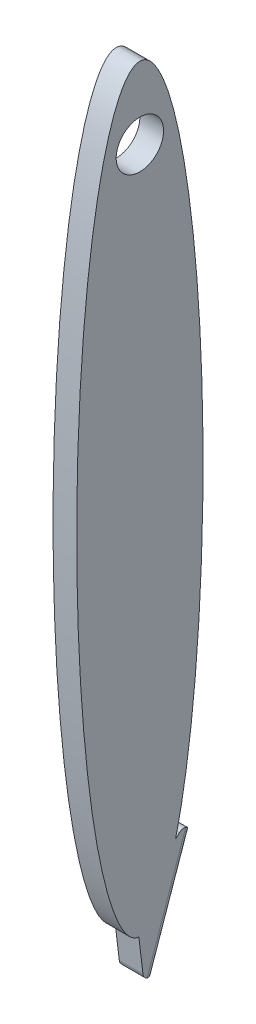
ISO-10303-21;
HEADER;
FILE_DESCRIPTION(('STEP AP214'),'2;1');
FILE_NAME('part.step','',(''),(''),'','','');
FILE_SCHEMA(('AUTOMOTIVE_DESIGN { 1 0 10303 214 1 1 1 1 }'));
ENDSEC;
DATA;
#1=APPLICATION_CONTEXT('core data for automotive mechanical design processes');
#2=APPLICATION_PROTOCOL_DEFINITION('international standard','automotive_design',2000,#1);
#3=PRODUCT_CONTEXT('',#1,'mechanical');
#4=PRODUCT('Part','Part','',(#3));
#5=PRODUCT_RELATED_PRODUCT_CATEGORY('part','',(#4));
#6=PRODUCT_DEFINITION_FORMATION('','',#4);
#7=PRODUCT_DEFINITION_CONTEXT('part definition',#1,'design');
#8=PRODUCT_DEFINITION('design','',#6,#7);
#9=PRODUCT_DEFINITION_SHAPE('','',#8);
#10=(LENGTH_UNIT() NAMED_UNIT(*) SI_UNIT(.MILLI.,.METRE.));
#11=(NAMED_UNIT(*) PLANE_ANGLE_UNIT() SI_UNIT($,.RADIAN.));
#12=(NAMED_UNIT(*) SI_UNIT($,.STERADIAN.) SOLID_ANGLE_UNIT());
#13=UNCERTAINTY_MEASURE_WITH_UNIT(LENGTH_MEASURE(1.E-05),#10,'distance_accuracy_value','');
#14=(GEOMETRIC_REPRESENTATION_CONTEXT(3) GLOBAL_UNCERTAINTY_ASSIGNED_CONTEXT((#13)) GLOBAL_UNIT_ASSIGNED_CONTEXT((#10,
#11,#12)) REPRESENTATION_CONTEXT('',''));
#15=CARTESIAN_POINT('',(0.,0.,0.));
#16=DIRECTION('',(0.,0.,1.));
#17=DIRECTION('',(1.,0.,0.));
#18=AXIS2_PLACEMENT_3D('',#15,#16,#17);
#19=CARTESIAN_POINT('',(4.7625,0.,0.));
#20=DIRECTION('',(1.,0.,0.));
#21=DIRECTION('',(0.,1.,0.));
#22=AXIS2_PLACEMENT_3D('',#19,#20,#21);
#23=ELLIPSE('',#22,76.2,12.7);
#24=DIRECTION('',(-1.,0.,0.));
#25=VECTOR('',#24,1.);
#26=SURFACE_OF_LINEAR_EXTRUSION('',#23,#25);
#27=DIRECTION('',(-1.,0.,0.));
#28=VECTOR('',#27,1.);
#29=CARTESIAN_POINT('',(4.7625,-62.8071697837972,-7.19123583829124));
#30=LINE('',#29,#28);
#31=CARTESIAN_POINT('',(0.,-62.8071697837972,-7.19123583829124));
#32=VERTEX_POINT('',#31);
#33=CARTESIAN_POINT('',(4.7625,-62.8071697837972,-7.19123583829124));
#34=VERTEX_POINT('',#33);
#35=EDGE_CURVE('E111',#32,#34,#30,.F.);
#36=ORIENTED_EDGE('',*,*,#35,.F.);
#37=CARTESIAN_POINT('',(0.,0.,0.));
#38=DIRECTION('',(1.,0.,0.));
#39=DIRECTION('',(0.,1.,0.));
#40=AXIS2_PLACEMENT_3D('',#37,#38,#39);
#41=ELLIPSE('',#40,76.2,12.7);
#42=CARTESIAN_POINT('',(0.,-76.19000521947,0.205690210507004));
#43=VERTEX_POINT('',#42);
#44=EDGE_CURVE('E119',#32,#43,#41,.T.);
#45=ORIENTED_EDGE('',*,*,#44,.T.);
#46=DIRECTION('',(-1.,0.,0.));
#47=VECTOR('',#46,1.);
#48=CARTESIAN_POINT('',(4.7625,-76.19000521947,0.205690210507001));
#49=LINE('',#48,#47);
#50=CARTESIAN_POINT('',(4.7625,-76.19000521947,0.205690210507004));
#51=VERTEX_POINT('',#50);
#52=EDGE_CURVE('E130',#51,#43,#49,.T.);
#53=ORIENTED_EDGE('',*,*,#52,.F.);
#54=EDGE_CURVE('E125',#34,#51,#23,.T.);
#55=ORIENTED_EDGE('',*,*,#54,.F.);
#56=EDGE_LOOP('',(#36,#45,#53,#55));
#57=FACE_BOUND('',#56,.T.);
#58=ADVANCED_FACE('F42',(#57),#26,.F.);
#59=CARTESIAN_POINT('',(4.7625,0.,0.));
#60=DIRECTION('',(1.,0.,0.));
#61=DIRECTION('',(0.,0.,-1.));
#62=AXIS2_PLACEMENT_3D('',#59,#60,#61);
#63=PLANE('',#62);
#64=CARTESIAN_POINT('',(4.7625,61.7042130542581,0.));
#65=DIRECTION('',(1.,0.,0.));
#66=DIRECTION('',(0.,0.,-1.));
#67=AXIS2_PLACEMENT_3D('',#64,#65,#66);
#68=CIRCLE('',#67,4.7625);
#69=CARTESIAN_POINT('',(4.7625,61.7042130542581,-4.7625));
#70=VERTEX_POINT('',#69);
#71=EDGE_CURVE('E229',#70,#70,#68,.T.);
#72=ORIENTED_EDGE('',*,*,#71,.F.);
#73=EDGE_LOOP('',(#72));
#74=FACE_BOUND('',#73,.T.);
#75=DIRECTION('',(0.,-0.992683829823772,-0.120742759643833));
#76=VECTOR('',#75,1.);
#77=CARTESIAN_POINT('',(4.7625,-70.3886737663858,0.911321498344444));
#78=LINE('',#77,#76);
#79=CARTESIAN_POINT('',(4.7625,-83.1177908874531,-0.636954682703129));
#80=VERTEX_POINT('',#79);
#81=EDGE_CURVE('E133',#51,#80,#78,.T.);
#82=ORIENTED_EDGE('',*,*,#81,.T.);
#83=CARTESIAN_POINT('',(4.7625,-82.9644475827054,-1.89766314657932));
#84=DIRECTION('',(1.,0.,0.));
#85=DIRECTION('',(0.,0.,-1.));
#86=AXIS2_PLACEMENT_3D('',#83,#84,#85);
#87=CIRCLE('',#86,1.27);
#88=CARTESIAN_POINT('',(4.7625,-84.164291788204,-1.48140135091283));
#89=VERTEX_POINT('',#88);
#90=EDGE_CURVE('E52',#80,#89,#87,.T.);
#91=ORIENTED_EDGE('',*,*,#90,.T.);
#92=DIRECTION('',(0.,0.944759216928012,-0.327765193438182));
#93=VECTOR('',#92,1.);
#94=CARTESIAN_POINT('',(4.7625,-58.1738680379496,-10.4982557148661));
#95=LINE('',#94,#93);
#96=CARTESIAN_POINT('',(4.7625,-61.8278939129235,-9.23056498872186));
#97=VERTEX_POINT('',#96);
#98=EDGE_CURVE('E63',#89,#97,#95,.T.);
#99=ORIENTED_EDGE('',*,*,#98,.T.);
#100=CARTESIAN_POINT('',(4.7625,-63.0277381184221,-8.81430319305536));
#101=DIRECTION('',(1.,0.,0.));
#102=DIRECTION('',(0.,0.,-1.));
#103=AXIS2_PLACEMENT_3D('',#100,#101,#102);
#104=CIRCLE('',#103,1.27);
#105=CARTESIAN_POINT('',(4.7625,-62.1003900558791,-7.94659035409442));
#106=VERTEX_POINT('',#105);
#107=EDGE_CURVE('E189',#97,#106,#104,.T.);
#108=ORIENTED_EDGE('',*,*,#107,.T.);
#109=DIRECTION('',(0.,-0.683238455874757,0.730195324837045));
#110=VECTOR('',#109,1.);
#111=CARTESIAN_POINT('',(4.7625,-70.3886737663858,0.911321498344444));
#112=LINE('',#111,#110);
#113=EDGE_CURVE('E223',#106,#34,#112,.T.);
#114=ORIENTED_EDGE('',*,*,#113,.T.);
#115=ORIENTED_EDGE('',*,*,#54,.T.);
#116=EDGE_LOOP('',(#82,#91,#99,#108,#114,#115));
#117=FACE_BOUND('',#116,.T.);
#118=ADVANCED_FACE('F145',(#74,#117),#63,.T.);
#119=CARTESIAN_POINT('',(0.,0.,0.));
#120=DIRECTION('',(1.,0.,0.));
#121=DIRECTION('',(0.,0.,-1.));
#122=AXIS2_PLACEMENT_3D('',#119,#120,#121);
#123=PLANE('',#122);
#124=CARTESIAN_POINT('',(0.,61.7042130542581,0.));
#125=DIRECTION('',(1.,0.,0.));
#126=DIRECTION('',(0.,0.,-1.));
#127=AXIS2_PLACEMENT_3D('',#124,#125,#126);
#128=CIRCLE('',#127,4.7625);
#129=CARTESIAN_POINT('',(0.,61.7042130542581,-4.7625));
#130=VERTEX_POINT('',#129);
#131=EDGE_CURVE('E183',#130,#130,#128,.T.);
#132=ORIENTED_EDGE('',*,*,#131,.T.);
#133=EDGE_LOOP('',(#132));
#134=FACE_BOUND('',#133,.T.);
#135=DIRECTION('',(0.,0.944759216928012,-0.327765193438182));
#136=VECTOR('',#135,1.);
#137=CARTESIAN_POINT('',(0.,-9.50050125957846,-27.3845005818649));
#138=LINE('',#137,#136);
#139=CARTESIAN_POINT('',(0.,-61.8278939129235,-9.23056498872186));
#140=VERTEX_POINT('',#139);
#141=CARTESIAN_POINT('',(0.,-84.164291788204,-1.48140135091283));
#142=VERTEX_POINT('',#141);
#143=EDGE_CURVE('E202',#140,#142,#138,.F.);
#144=ORIENTED_EDGE('',*,*,#143,.T.);
#145=CARTESIAN_POINT('',(0.,-82.9644475827054,-1.89766314657932));
#146=DIRECTION('',(1.,0.,0.));
#147=DIRECTION('',(0.,0.,-1.));
#148=AXIS2_PLACEMENT_3D('',#145,#146,#147);
#149=CIRCLE('',#148,1.27);
#150=CARTESIAN_POINT('',(0.,-83.1177908874531,-0.636954682703129));
#151=VERTEX_POINT('',#150);
#152=EDGE_CURVE('E196',#142,#151,#149,.F.);
#153=ORIENTED_EDGE('',*,*,#152,.T.);
#154=DIRECTION('',(0.,-0.992683829823772,-0.120742759643833));
#155=VECTOR('',#154,1.);
#156=CARTESIAN_POINT('',(0.,-70.3886737663858,0.911321498344444));
#157=LINE('',#156,#155);
#158=EDGE_CURVE('E116',#43,#151,#157,.T.);
#159=ORIENTED_EDGE('',*,*,#158,.F.);
#160=ORIENTED_EDGE('',*,*,#44,.F.);
#161=DIRECTION('',(0.,-0.683238455874757,0.730195324837045));
#162=VECTOR('',#161,1.);
#163=CARTESIAN_POINT('',(0.,-70.3886737663858,0.911321498344444));
#164=LINE('',#163,#162);
#165=CARTESIAN_POINT('',(0.,-62.1003900558791,-7.94659035409442));
#166=VERTEX_POINT('',#165);
#167=EDGE_CURVE('E106',#166,#32,#164,.T.);
#168=ORIENTED_EDGE('',*,*,#167,.F.);
#169=CARTESIAN_POINT('',(0.,-63.0277381184221,-8.81430319305536));
#170=DIRECTION('',(1.,0.,0.));
#171=DIRECTION('',(0.,0.,-1.));
#172=AXIS2_PLACEMENT_3D('',#169,#170,#171);
#173=CIRCLE('',#172,1.27);
#174=EDGE_CURVE('E199',#166,#140,#173,.F.);
#175=ORIENTED_EDGE('',*,*,#174,.T.);
#176=EDGE_LOOP('',(#144,#153,#159,#160,#168,#175));
#177=FACE_BOUND('',#176,.T.);
#178=ADVANCED_FACE('F120',(#134,#177),#123,.F.);
#179=CARTESIAN_POINT('',(4.7625,-70.3886737663858,0.911321498344444));
#180=DIRECTION('',(0.,-0.730195324837045,-0.683238455874757));
#181=DIRECTION('',(0.,0.683238455874757,-0.730195324837045));
#182=AXIS2_PLACEMENT_3D('',#179,#180,#181);
#183=PLANE('',#182);
#184=ORIENTED_EDGE('',*,*,#113,.F.);
#185=DIRECTION('',(-1.,0.,0.));
#186=VECTOR('',#185,1.);
#187=CARTESIAN_POINT('',(4.7625,-62.1003900558791,-7.94659035409443));
#188=LINE('',#187,#186);
#189=EDGE_CURVE('E11',#106,#166,#188,.T.);
#190=ORIENTED_EDGE('',*,*,#189,.T.);
#191=ORIENTED_EDGE('',*,*,#167,.T.);
#192=ORIENTED_EDGE('',*,*,#35,.T.);
#193=EDGE_LOOP('',(#184,#190,#191,#192));
#194=FACE_BOUND('',#193,.T.);
#195=ADVANCED_FACE('F109',(#194),#183,.F.);
#196=CARTESIAN_POINT('',(4.7625,-70.3886737663858,0.911321498344444));
#197=DIRECTION('',(0.,0.120742759643833,-0.992683829823772));
#198=DIRECTION('',(0.,0.992683829823772,0.120742759643833));
#199=AXIS2_PLACEMENT_3D('',#196,#197,#198);
#200=PLANE('',#199);
#201=ORIENTED_EDGE('',*,*,#158,.T.);
#202=DIRECTION('',(-1.,0.,0.));
#203=VECTOR('',#202,1.);
#204=CARTESIAN_POINT('',(4.7625,-83.1177908874531,-0.636954682703129));
#205=LINE('',#204,#203);
#206=EDGE_CURVE('E192',#151,#80,#205,.F.);
#207=ORIENTED_EDGE('',*,*,#206,.T.);
#208=ORIENTED_EDGE('',*,*,#81,.F.);
#209=ORIENTED_EDGE('',*,*,#52,.T.);
#210=EDGE_LOOP('',(#201,#207,#208,#209));
#211=FACE_BOUND('',#210,.T.);
#212=ADVANCED_FACE('F220',(#211),#200,.F.);
#213=CARTESIAN_POINT('',(4.7625,-88.5637385691688,-1.29935970251998));
#214=DIRECTION('',(0.,0.327765193438182,0.944759216928012));
#215=DIRECTION('',(0.,-0.944759216928012,0.327765193438182));
#216=AXIS2_PLACEMENT_3D('',#213,#214,#215);
#217=PLANE('',#216);
#218=DIRECTION('',(0.,0.944759216928012,-0.327765193438182));
#219=VECTOR('',#218,1.);
#220=CARTESIAN_POINT('',(3.4925,-88.5637385691688,-1.29935970251998));
#221=LINE('',#220,#219);
#222=CARTESIAN_POINT('',(3.4925,-63.4439999140886,-10.0141473985539));
#223=VERTEX_POINT('',#222);
#224=CARTESIAN_POINT('',(3.4925,-83.3807093783719,-3.0975073520779));
#225=VERTEX_POINT('',#224);
#226=EDGE_CURVE('E168',#223,#225,#221,.F.);
#227=ORIENTED_EDGE('',*,*,#226,.T.);
#228=DIRECTION('',(-1.,0.,0.));
#229=VECTOR('',#228,1.);
#230=CARTESIAN_POINT('',(4.7625,-83.3807093783719,-3.0975073520779));
#231=LINE('',#230,#229);
#232=CARTESIAN_POINT('',(1.27,-83.3807093783719,-3.0975073520779));
#233=VERTEX_POINT('',#232);
#234=EDGE_CURVE('E205',#225,#233,#231,.T.);
#235=ORIENTED_EDGE('',*,*,#234,.T.);
#236=DIRECTION('',(0.,0.944759216928012,-0.327765193438182));
#237=VECTOR('',#236,1.);
#238=CARTESIAN_POINT('',(1.27,-88.5637385691688,-1.29935970251998));
#239=LINE('',#238,#237);
#240=CARTESIAN_POINT('',(1.27,-63.4439999140886,-10.0141473985539));
#241=VERTEX_POINT('',#240);
#242=EDGE_CURVE('E139',#233,#241,#239,.T.);
#243=ORIENTED_EDGE('',*,*,#242,.T.);
#244=DIRECTION('',(-1.,0.,0.));
#245=VECTOR('',#244,1.);
#246=CARTESIAN_POINT('',(4.7625,-63.4439999140886,-10.0141473985539));
#247=LINE('',#246,#245);
#248=EDGE_CURVE('E211',#241,#223,#247,.F.);
#249=ORIENTED_EDGE('',*,*,#248,.T.);
#250=EDGE_LOOP('',(#227,#235,#243,#249));
#251=FACE_BOUND('',#250,.T.);
#252=ADVANCED_FACE('F161',(#251),#217,.F.);
#253=CARTESIAN_POINT('',(4.7625,-63.0277381184221,-8.81430319305536));
#254=DIRECTION('',(-1.,0.,0.));
#255=DIRECTION('',(0.,0.,1.));
#256=AXIS2_PLACEMENT_3D('',#253,#254,#255);
#257=CYLINDRICAL_SURFACE('',#256,1.27);
#258=ORIENTED_EDGE('',*,*,#189,.F.);
#259=ORIENTED_EDGE('',*,*,#107,.F.);
#260=CARTESIAN_POINT('',(3.4925,-63.0277381184221,-8.81430319305537));
#261=DIRECTION('',(-0.707106781186547,0.66804564887829,-0.231764990917059));
#262=DIRECTION('',(-0.707106781186547,-0.66804564887829,0.231764990917059));
#263=AXIS2_PLACEMENT_3D('',#260,#261,#262);
#264=ELLIPSE('',#263,1.79605122421383,1.27);
#265=EDGE_CURVE('E46',#223,#97,#264,.F.);
#266=ORIENTED_EDGE('',*,*,#265,.F.);
#267=ORIENTED_EDGE('',*,*,#248,.F.);
#268=CARTESIAN_POINT('',(1.27,-63.0277381184221,-8.81430319305537));
#269=DIRECTION('',(0.707106781186547,0.66804564887829,-0.231764990917059));
#270=DIRECTION('',(-0.707106781186547,0.66804564887829,-0.231764990917059));
#271=AXIS2_PLACEMENT_3D('',#268,#269,#270);
#272=ELLIPSE('',#271,1.79605122421383,1.27);
#273=EDGE_CURVE('E171',#140,#241,#272,.F.);
#274=ORIENTED_EDGE('',*,*,#273,.F.);
#275=ORIENTED_EDGE('',*,*,#174,.F.);
#276=EDGE_LOOP('',(#258,#259,#266,#267,#274,#275));
#277=FACE_BOUND('',#276,.T.);
#278=ADVANCED_FACE('F44',(#277),#257,.T.);
#279=CARTESIAN_POINT('',(3.4925,-9.50050125957846,-27.3845005818649));
#280=DIRECTION('',(0.,-0.944759216928012,0.327765193438182));
#281=DIRECTION('',(0.,-0.327765193438182,-0.944759216928012));
#282=AXIS2_PLACEMENT_3D('',#279,#280,#281);
#283=CYLINDRICAL_SURFACE('',#282,1.27);
#284=ORIENTED_EDGE('',*,*,#265,.T.);
#285=ORIENTED_EDGE('',*,*,#98,.F.);
#286=CARTESIAN_POINT('',(3.4925,-82.9644475827054,-1.89766314657932));
#287=DIRECTION('',(-0.707106781186547,-0.66804564887829,0.231764990917059));
#288=DIRECTION('',(0.707106781186547,-0.66804564887829,0.231764990917059));
#289=AXIS2_PLACEMENT_3D('',#286,#287,#288);
#290=ELLIPSE('',#289,1.79605122421383,1.27);
#291=EDGE_CURVE('E174',#225,#89,#290,.T.);
#292=ORIENTED_EDGE('',*,*,#291,.F.);
#293=ORIENTED_EDGE('',*,*,#226,.F.);
#294=EDGE_LOOP('',(#284,#285,#292,#293));
#295=FACE_BOUND('',#294,.T.);
#296=ADVANCED_FACE('F154',(#295),#283,.T.);
#297=CARTESIAN_POINT('',(1.27,-88.1474767735023,-0.0995154970214092));
#298=DIRECTION('',(0.,0.944759216928012,-0.327765193438182));
#299=DIRECTION('',(0.,0.327765193438182,0.944759216928012));
#300=AXIS2_PLACEMENT_3D('',#297,#298,#299);
#301=CYLINDRICAL_SURFACE('',#300,1.27);
#302=ORIENTED_EDGE('',*,*,#273,.T.);
#303=ORIENTED_EDGE('',*,*,#242,.F.);
#304=CARTESIAN_POINT('',(1.27,-82.9644475827054,-1.89766314657932));
#305=DIRECTION('',(-0.707106781186547,0.66804564887829,-0.231764990917059));
#306=DIRECTION('',(0.707106781186547,0.66804564887829,-0.231764990917059));
#307=AXIS2_PLACEMENT_3D('',#304,#305,#306);
#308=ELLIPSE('',#307,1.79605122421383,1.27);
#309=EDGE_CURVE('E179',#142,#233,#308,.F.);
#310=ORIENTED_EDGE('',*,*,#309,.F.);
#311=ORIENTED_EDGE('',*,*,#143,.F.);
#312=EDGE_LOOP('',(#302,#303,#310,#311));
#313=FACE_BOUND('',#312,.T.);
#314=ADVANCED_FACE('F151',(#313),#301,.T.);
#315=CARTESIAN_POINT('',(4.7625,-82.9644475827054,-1.89766314657932));
#316=DIRECTION('',(-1.,0.,0.));
#317=DIRECTION('',(0.,0.,1.));
#318=AXIS2_PLACEMENT_3D('',#315,#316,#317);
#319=CYLINDRICAL_SURFACE('',#318,1.27);
#320=ORIENTED_EDGE('',*,*,#90,.F.);
#321=ORIENTED_EDGE('',*,*,#206,.F.);
#322=ORIENTED_EDGE('',*,*,#152,.F.);
#323=ORIENTED_EDGE('',*,*,#309,.T.);
#324=ORIENTED_EDGE('',*,*,#234,.F.);
#325=ORIENTED_EDGE('',*,*,#291,.T.);
#326=EDGE_LOOP('',(#320,#321,#322,#323,#324,#325));
#327=FACE_BOUND('',#326,.T.);
#328=ADVANCED_FACE('F147',(#327),#319,.T.);
#329=CARTESIAN_POINT('',(0.,61.7042130542581,0.));
#330=DIRECTION('',(1.,0.,0.));
#331=DIRECTION('',(0.,0.,-1.));
#332=AXIS2_PLACEMENT_3D('',#329,#330,#331);
#333=CYLINDRICAL_SURFACE('',#332,4.7625);
#334=ORIENTED_EDGE('',*,*,#131,.F.);
#335=EDGE_LOOP('',(#334));
#336=FACE_BOUND('',#335,.T.);
#337=ORIENTED_EDGE('',*,*,#71,.T.);
#338=EDGE_LOOP('',(#337));
#339=FACE_BOUND('',#338,.T.);
#340=ADVANCED_FACE('F150',(#336,#339),#333,.F.);
#341=CLOSED_SHELL('',(#58,#118,#178,#195,#212,#252,#278,#296,#314,#328,#340));
#342=MANIFOLD_SOLID_BREP('B2',#341);
#343=ADVANCED_BREP_SHAPE_REPRESENTATION('',(#18,#342),#14);
#344=SHAPE_DEFINITION_REPRESENTATION(#9,#343);
ENDSEC;
END-ISO-10303-21;
